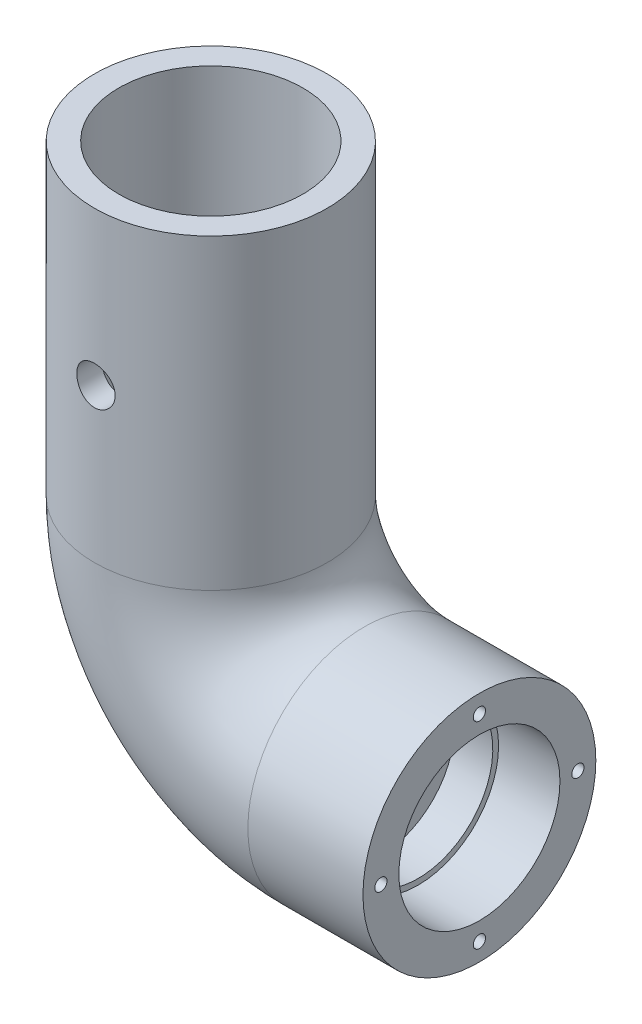
ISO-10303-21;
HEADER;
FILE_DESCRIPTION(('STEP AP214'),'2;1');
FILE_NAME('part.step','',(''),(''),'','','');
FILE_SCHEMA(('AUTOMOTIVE_DESIGN { 1 0 10303 214 1 1 1 1 }'));
ENDSEC;
DATA;
#1=APPLICATION_CONTEXT('core data for automotive mechanical design processes');
#2=APPLICATION_PROTOCOL_DEFINITION('international standard','automotive_design',2000,#1);
#3=PRODUCT_CONTEXT('',#1,'mechanical');
#4=PRODUCT('Part','Part','',(#3));
#5=PRODUCT_RELATED_PRODUCT_CATEGORY('part','',(#4));
#6=PRODUCT_DEFINITION_FORMATION('','',#4);
#7=PRODUCT_DEFINITION_CONTEXT('part definition',#1,'design');
#8=PRODUCT_DEFINITION('design','',#6,#7);
#9=PRODUCT_DEFINITION_SHAPE('','',#8);
#10=(LENGTH_UNIT() NAMED_UNIT(*) SI_UNIT(.MILLI.,.METRE.));
#11=(NAMED_UNIT(*) PLANE_ANGLE_UNIT() SI_UNIT($,.RADIAN.));
#12=(NAMED_UNIT(*) SI_UNIT($,.STERADIAN.) SOLID_ANGLE_UNIT());
#13=UNCERTAINTY_MEASURE_WITH_UNIT(LENGTH_MEASURE(1.E-05),#10,'distance_accuracy_value','');
#14=(GEOMETRIC_REPRESENTATION_CONTEXT(3) GLOBAL_UNCERTAINTY_ASSIGNED_CONTEXT((#13)) GLOBAL_UNIT_ASSIGNED_CONTEXT((#10,
#11,#12)) REPRESENTATION_CONTEXT('',''));
#15=CARTESIAN_POINT('',(0.,0.,0.));
#16=DIRECTION('',(0.,0.,1.));
#17=DIRECTION('',(1.,0.,0.));
#18=AXIS2_PLACEMENT_3D('',#15,#16,#17);
#19=CARTESIAN_POINT('',(0.,0.,0.));
#20=DIRECTION('',(0.,-1.,0.));
#21=DIRECTION('',(1.,0.,0.));
#22=AXIS2_PLACEMENT_3D('',#19,#20,#21);
#23=CYLINDRICAL_SURFACE('',#22,15.175);
#24=CARTESIAN_POINT('',(0.,-22.5,-15.175));
#25=CARTESIAN_POINT('',(0.139414398865808,-22.4999943896346,-15.1749976272161));
#26=CARTESIAN_POINT('',(0.278905464425863,-22.4882987839139,-15.1730587501058));
#27=CARTESIAN_POINT('',(0.553976908617769,-22.4418439121575,-15.1655108774113));
#28=CARTESIAN_POINT('',(0.689553544166285,-22.4070632871692,-15.1598984830454));
#29=CARTESIAN_POINT('',(0.952776474581509,-22.315515683128,-15.1456332250792));
#30=CARTESIAN_POINT('',(1.08042910035957,-22.2587665252279,-15.1369828264729));
#31=CARTESIAN_POINT('',(1.32438387408,-22.1249390484941,-15.1175932663015));
#32=CARTESIAN_POINT('',(1.44068735130687,-22.0478631143867,-15.1068543497989));
#33=CARTESIAN_POINT('',(1.65974650354689,-21.8748032292909,-15.0843664117185));
#34=CARTESIAN_POINT('',(1.76238066959243,-21.7786664565595,-15.0726096897185));
#35=CARTESIAN_POINT('',(1.95013834034263,-21.5705427935558,-15.0494702952056));
#36=CARTESIAN_POINT('',(2.03526075187495,-21.4585549145134,-15.0380876460815));
#37=CARTESIAN_POINT('',(2.1860638853002,-21.2210754679183,-15.0169105867145));
#38=CARTESIAN_POINT('',(2.25162476280527,-21.095506832648,-15.0071261266247));
#39=CARTESIAN_POINT('',(2.36067746971198,-20.834951174242,-14.9903599037316));
#40=CARTESIAN_POINT('',(2.40417075477263,-20.6999647730048,-14.9833779560707));
#41=CARTESIAN_POINT('',(2.46747147831426,-20.4256921790696,-14.9730838150865));
#42=CARTESIAN_POINT('',(2.4874884856634,-20.2864555946552,-14.9697391720144));
#43=CARTESIAN_POINT('',(2.50391814790731,-20.0065628667282,-14.967000127247));
#44=CARTESIAN_POINT('',(2.5003324350801,-19.8659068220521,-14.9676054523863));
#45=CARTESIAN_POINT('',(2.46982921038924,-19.5886620157808,-14.9726683175695));
#46=CARTESIAN_POINT('',(2.44314687659403,-19.4520465670754,-14.9770870270074));
#47=CARTESIAN_POINT('',(2.36757678705423,-19.1852583708687,-14.9892180148866));
#48=CARTESIAN_POINT('',(2.31868828567482,-19.0550858398695,-14.9969304039221));
#49=CARTESIAN_POINT('',(2.19985444806369,-18.8041731671425,-15.0148218186591));
#50=CARTESIAN_POINT('',(2.12981121823907,-18.6834802364751,-15.025012267932));
#51=CARTESIAN_POINT('',(1.97072572320153,-18.4554715653313,-15.0467036259348));
#52=CARTESIAN_POINT('',(1.88168195896249,-18.3481568813758,-15.0582046380267));
#53=CARTESIAN_POINT('',(1.68584050335828,-18.1485894502835,-15.0813919807029));
#54=CARTESIAN_POINT('',(1.57884098184814,-18.0565347149305,-15.0930788695123));
#55=CARTESIAN_POINT('',(1.35080857293345,-17.8916566165645,-15.1151924066283));
#56=CARTESIAN_POINT('',(1.22977559891994,-17.8188333722498,-15.1256190471563));
#57=CARTESIAN_POINT('',(0.976927538134907,-17.6944683679727,-15.1440516025845));
#58=CARTESIAN_POINT('',(0.845103827113141,-17.6429438334506,-15.1520555567296));
#59=CARTESIAN_POINT('',(0.574512707580694,-17.5628212020278,-15.1647250919528));
#60=CARTESIAN_POINT('',(0.435745867449411,-17.5342212317249,-15.1693909458181));
#61=CARTESIAN_POINT('',(0.156914525463659,-17.5010273885496,-15.1748219504465));
#62=CARTESIAN_POINT('',(0.0168832197418992,-17.496161638441,-15.1756312755361));
#63=CARTESIAN_POINT('',(-0.261994008747119,-17.5098499053041,-15.1733789340442));
#64=CARTESIAN_POINT('',(-0.400839975845774,-17.5284030425174,-15.1703174128756));
#65=CARTESIAN_POINT('',(-0.672567381257066,-17.5881763026265,-15.1606947221205));
#66=CARTESIAN_POINT('',(-0.805479169890742,-17.6292620824038,-15.1541543011709));
#67=CARTESIAN_POINT('',(-1.06252816449593,-17.7327913246536,-15.1383043082592));
#68=CARTESIAN_POINT('',(-1.18666488669078,-17.7952359635511,-15.1289945837702));
#69=CARTESIAN_POINT('',(-1.42382265695125,-17.9403348574233,-15.1085293914326));
#70=CARTESIAN_POINT('',(-1.53673826212985,-18.0231592592062,-15.0973586539619));
#71=CARTESIAN_POINT('',(-1.74716482059952,-18.206432202769,-15.0744573429873));
#72=CARTESIAN_POINT('',(-1.84467468125567,-18.3068819935443,-15.0627267298517));
#73=CARTESIAN_POINT('',(-2.02252736832566,-18.5237726086314,-15.0398852756684));
#74=CARTESIAN_POINT('',(-2.10268667257686,-18.640364832744,-15.0287818993821));
#75=CARTESIAN_POINT('',(-2.2422818354755,-18.8855194334708,-15.0085906335615));
#76=CARTESIAN_POINT('',(-2.30171834000595,-19.0140814368556,-14.9995026812143));
#77=CARTESIAN_POINT('',(-2.39790504111838,-19.2790089514247,-14.9844270142086));
#78=CARTESIAN_POINT('',(-2.43474721383671,-19.4153403225006,-14.9784267466052));
#79=CARTESIAN_POINT('',(-2.48498928304665,-19.6923633131354,-14.9701741030155));
#80=CARTESIAN_POINT('',(-2.49839116632715,-19.8330545621239,-14.9679214093872));
#81=CARTESIAN_POINT('',(-2.50131779480933,-20.1129714213662,-14.9674324446329));
#82=CARTESIAN_POINT('',(-2.49113137271242,-20.2521940114351,-14.9691475881172));
#83=CARTESIAN_POINT('',(-2.44779442269011,-20.5269157289199,-14.9762946698811));
#84=CARTESIAN_POINT('',(-2.41464396432517,-20.6624148676133,-14.981726596902));
#85=CARTESIAN_POINT('',(-2.32642959985729,-20.925735464551,-14.995676918027));
#86=CARTESIAN_POINT('',(-2.27139000080984,-21.0535652587068,-15.0041918875934));
#87=CARTESIAN_POINT('',(-2.14098927733165,-21.2982232322297,-15.0233522865409));
#88=CARTESIAN_POINT('',(-2.06562718298227,-21.4150508861456,-15.0339978175995));
#89=CARTESIAN_POINT('',(-1.89568766005889,-21.6358485375619,-15.0563741511314));
#90=CARTESIAN_POINT('',(-1.80089756283132,-21.7396537447931,-15.0681161060429));
#91=CARTESIAN_POINT('',(-1.59524139211507,-21.9299838666002,-15.0912728166213));
#92=CARTESIAN_POINT('',(-1.48437161109691,-22.0165047849302,-15.1026874960986));
#93=CARTESIAN_POINT('',(-1.2488170646922,-22.1703413571105,-15.123992442743));
#94=CARTESIAN_POINT('',(-1.12404431677095,-22.2375237923058,-15.1338719296207));
#95=CARTESIAN_POINT('',(-0.864873538687186,-22.3498726180061,-15.1508883617483));
#96=CARTESIAN_POINT('',(-0.730485296368456,-22.3950610411048,-15.1580280500793));
#97=CARTESIAN_POINT('',(-0.496304062504727,-22.4522773457695,-15.1671937279183));
#98=CARTESIAN_POINT('',(-0.397931369105154,-22.4701448389185,-15.1701055070724));
#99=CARTESIAN_POINT('',(-0.199718884105704,-22.4940080772245,-15.1740094771408));
#100=CARTESIAN_POINT('',(-0.0998791168774065,-22.5000040193721,-15.1750016999073));
#101=CARTESIAN_POINT('',(0.,-22.5,-15.175));
#102=B_SPLINE_CURVE_WITH_KNOTS('',3,(#24,#25,#26,#27,#28,#29,#30,#31,#32,#33,#34,#35,#36,#37,
#38,#39,#40,#41,#42,#43,#44,#45,#46,#47,#48,#49,#50,#51,#52,#53,#54,#55,#56,#57,#58,#59,#60,#61,
#62,#63,#64,#65,#66,#67,#68,#69,#70,#71,#72,#73,#74,#75,#76,#77,#78,#79,#80,#81,#82,#83,#84,#85,
#86,#87,#88,#89,#90,#91,#92,#93,#94,#95,#96,#97,#98,#99,#100,#101),.UNSPECIFIED.,.T.,.F.,(4,2,2,
2,2,2,2,2,2,2,2,2,2,2,2,2,2,2,2,2,2,2,2,2,2,2,2,2,2,2,2,2,2,2,2,2,2,2,4),(0.,0.41787812372333,
0.836143420794595,1.25407012437152,1.67194781881058,2.09332223264384,2.51472294282414,
2.93865473107456,3.36255855159899,3.78264873313769,4.20270986307726,4.6185434319839,
5.03439096470981,5.45219311037727,5.87002823027735,6.29292034777012,6.71581507532566,
7.13905115513656,7.56225264444306,7.98059475770539,8.39892115591529,8.81478012172434,
9.23066199632983,9.6501413772678,10.0696504959617,10.4934007808007,10.9171378571164,
11.3391383481926,11.7611030689542,12.177928306698,12.5947522818403,13.0111146765413,
13.42749694622,13.8487071405818,14.2700146091994,14.6941584789878,15.1178765818797,
15.4172573552029,15.716633160711),.UNSPECIFIED.);
#103=CARTESIAN_POINT('',(0.,-22.5,-15.175));
#104=VERTEX_POINT('',#103);
#105=EDGE_CURVE('E120',#104,#104,#102,.T.);
#106=ORIENTED_EDGE('',*,*,#105,.T.);
#107=EDGE_LOOP('',(#106));
#108=FACE_BOUND('',#107,.T.);
#109=CARTESIAN_POINT('',(2.5,-20.,14.9676526215703));
#110=CARTESIAN_POINT('',(2.49999437753145,-20.1393999267453,14.9676551180879));
#111=CARTESIAN_POINT('',(2.48830111786953,-20.2788765566367,14.9696211562426));
#112=CARTESIAN_POINT('',(2.44185640998583,-20.5539180169733,14.9772659392603));
#113=CARTESIAN_POINT('',(2.40708354964725,-20.6894790927744,14.9829481317163));
#114=CARTESIAN_POINT('',(2.31555865143851,-20.9526690924642,14.9973645861903));
#115=CARTESIAN_POINT('',(2.25882480120892,-21.0803044790087,15.0060963220557));
#116=CARTESIAN_POINT('',(2.12503339399969,-21.3242302625616,15.0256250294047));
#117=CARTESIAN_POINT('',(2.04797818538789,-21.4405219683377,15.0364217622144));
#118=CARTESIAN_POINT('',(1.87493941802263,-21.6595939794028,15.058980173431));
#119=CARTESIAN_POINT('',(1.77879839195252,-21.7622491485628,15.070749368773));
#120=CARTESIAN_POINT('',(1.57065734652026,-21.9500474796948,15.093859799345));
#121=CARTESIAN_POINT('',(1.45865639626467,-22.0351896130247,15.1052010094051));
#122=CARTESIAN_POINT('',(1.22116506767708,-22.1860137177612,15.1262570623383));
#123=CARTESIAN_POINT('',(1.09559987050167,-22.2515793723053,15.1359620405751));
#124=CARTESIAN_POINT('',(0.835051668386316,-22.3606418535047,15.1525685385449));
#125=CARTESIAN_POINT('',(0.700069262525742,-22.4041400825342,15.1594702364195));
#126=CARTESIAN_POINT('',(0.425810661145654,-22.4674506254424,15.1696394784589));
#127=CARTESIAN_POINT('',(0.286584197046825,-22.4874731126365,15.1729392511872));
#128=CARTESIAN_POINT('',(0.00671141486839491,-22.5039172432033,15.1756435441433));
#129=CARTESIAN_POINT('',(-0.133934808197582,-22.5003404555765,15.1750483233304));
#130=CARTESIAN_POINT('',(-0.41121803848185,-22.469851710033,15.1700552355333));
#131=CARTESIAN_POINT('',(-0.547880673761921,-22.4431659306239,15.1656942272407));
#132=CARTESIAN_POINT('',(-0.814761449668491,-22.3675727282069,15.1537006619462));
#133=CARTESIAN_POINT('',(-0.944979397431581,-22.3186646406206,15.1460680071031));
#134=CARTESIAN_POINT('',(-1.19594846883266,-22.1997895495433,15.1283259313806));
#135=CARTESIAN_POINT('',(-1.31665452718145,-22.129729105392,15.1182055586322));
#136=CARTESIAN_POINT('',(-1.54468222462871,-21.9706064898069,15.0966128588608));
#137=CARTESIAN_POINT('',(-1.65200280365272,-21.8815428149081,15.0851404249));
#138=CARTESIAN_POINT('',(-1.85154905797987,-21.6856867861696,15.0619593732846));
#139=CARTESIAN_POINT('',(-1.9435806997378,-21.578696775483,15.050249568021));
#140=CARTESIAN_POINT('',(-2.10841667184125,-21.3506917785872,15.0280452193332));
#141=CARTESIAN_POINT('',(-2.18122083261723,-21.2296766687026,15.017550686627));
#142=CARTESIAN_POINT('',(-2.30557190897048,-20.9768343582631,14.9989646164783));
#143=CARTESIAN_POINT('',(-2.35709587383962,-20.8449956671501,14.9908756760863));
#144=CARTESIAN_POINT('',(-2.43721281865678,-20.5743718545755,14.9780599773409));
#145=CARTESIAN_POINT('',(-2.46580776855682,-20.4355873309555,14.9733329301534));
#146=CARTESIAN_POINT('',(-2.49898261040989,-20.156746346404,14.9678319843484));
#147=CARTESIAN_POINT('',(-2.50383891364147,-20.0167236395285,14.9670125880507));
#148=CARTESIAN_POINT('',(-2.49013482253626,-19.7378658422321,14.9692985803764));
#149=CARTESIAN_POINT('',(-2.47157531103841,-19.5990307072352,14.9724038210305));
#150=CARTESIAN_POINT('',(-2.41180194782285,-19.3273644989315,14.9821471978688));
#151=CARTESIAN_POINT('',(-2.37072843313684,-19.1945016933949,14.9887634407823));
#152=CARTESIAN_POINT('',(-2.26724002928118,-18.93754527134,15.0047650039361));
#153=CARTESIAN_POINT('',(-2.20482388981765,-18.8134521690826,15.0141504863996));
#154=CARTESIAN_POINT('',(-2.05976821986048,-18.576326441883,15.0347389141977));
#155=CARTESIAN_POINT('',(-1.97695134127624,-18.4634036865835,15.0459574904166));
#156=CARTESIAN_POINT('',(-1.793688852085,-18.2529592243713,15.0689021728662));
#157=CARTESIAN_POINT('',(-1.69324203106521,-18.1554385757896,15.080628313903));
#158=CARTESIAN_POINT('',(-1.47634722768876,-17.977559240765,15.1034105920265));
#159=CARTESIAN_POINT('',(-1.35974721238203,-17.89738475317,15.1144587225039));
#160=CARTESIAN_POINT('',(-1.11457265927855,-17.7577629854935,15.1345121885892));
#161=CARTESIAN_POINT('',(-0.985998502079841,-17.6983150469034,15.143517589094));
#162=CARTESIAN_POINT('',(-0.721075975376979,-17.6021214508171,15.1584360969103));
#163=CARTESIAN_POINT('',(-0.584763567857759,-17.5652788841367,15.1643623873628));
#164=CARTESIAN_POINT('',(-0.30778084171827,-17.5150296135941,15.1725106301449));
#165=CARTESIAN_POINT('',(-0.167110874028081,-17.5016210274765,15.1747328799885));
#166=CARTESIAN_POINT('',(0.11281497152143,-17.4986735132137,15.1752185964705));
#167=CARTESIAN_POINT('',(0.252067895513671,-17.5088541334636,15.1735285762314));
#168=CARTESIAN_POINT('',(0.52685180012298,-17.5521900955504,15.166474457857));
#169=CARTESIAN_POINT('',(0.662382800422101,-17.5853453158702,15.1611103791546));
#170=CARTESIAN_POINT('',(0.925772139210983,-17.6735826635033,15.1473086471497));
#171=CARTESIAN_POINT('',(1.05363847085306,-17.7286414740673,15.1388742630488));
#172=CARTESIAN_POINT('',(1.29836159830794,-17.859092025037,15.1198533321971));
#173=CARTESIAN_POINT('',(1.41521789129942,-17.9344846934699,15.1092666872237));
#174=CARTESIAN_POINT('',(1.636017776678,-18.1044594735508,15.0869659065394));
#175=CARTESIAN_POINT('',(1.73980198404174,-18.1992471672561,15.075240464941));
#176=CARTESIAN_POINT('',(1.93009085206402,-18.4048896771067,15.0520625438541));
#177=CARTESIAN_POINT('',(2.01659145961134,-18.5157482514807,15.0406101289453));
#178=CARTESIAN_POINT('',(2.17040420392537,-18.7512921233202,15.0191897349432));
#179=CARTESIAN_POINT('',(2.23757995888379,-18.8760674645766,15.009232532672));
#180=CARTESIAN_POINT('',(2.34991559412669,-19.1352433660101,14.9920571811202));
#181=CARTESIAN_POINT('',(2.39509757159692,-19.2696341091762,14.984836284292));
#182=CARTESIAN_POINT('',(2.45229718265444,-19.503798457514,14.9755606203287));
#183=CARTESIAN_POINT('',(2.47015720034298,-19.602150625457,14.9726115170199));
#184=CARTESIAN_POINT('',(2.49401051915724,-19.8003220925829,14.9686566404333));
#185=CARTESIAN_POINT('',(2.50000402763504,-19.9001413660994,14.9676508331989));
#186=CARTESIAN_POINT('',(2.5,-20.,14.9676526215703));
#187=B_SPLINE_CURVE_WITH_KNOTS('',3,(#109,#110,#111,#112,#113,#114,#115,#116,#117,#118,#119,
#120,#121,#122,#123,#124,#125,#126,#127,#128,#129,#130,#131,#132,#133,#134,#135,#136,#137,#138,
#139,#140,#141,#142,#143,#144,#145,#146,#147,#148,#149,#150,#151,#152,#153,#154,#155,#156,#157,
#158,#159,#160,#161,#162,#163,#164,#165,#166,#167,#168,#169,#170,#171,#172,#173,#174,#175,#176,
#177,#178,#179,#180,#181,#182,#183,#184,#185,#186),.UNSPECIFIED.,.T.,.F.,(4,2,2,2,2,2,2,2,2,2,2,
2,2,2,2,2,2,2,2,2,2,2,2,2,2,2,2,2,2,2,2,2,2,2,2,2,2,2,4),(0.,0.417834635783439,
0.836057460827383,1.2539346608241,1.67176359142487,2.09319493100717,2.51465101663454,
2.93856357781654,3.36244919618391,3.78251015586624,4.20254318802481,4.61851103794085,
5.03449132857299,5.4523367909029,5.87021532387711,6.29304781911748,6.71588404324549,
7.13917511319949,7.56242981209845,7.98074422465046,8.39904286610005,8.81476328816452,
9.23050806814065,9.65000311215194,10.0695269685621,10.493308074036,10.9170757142241,
11.3390137329823,11.7609178594373,12.1778317545286,12.5947434444962,13.0112125072967,
13.4277005807589,13.8488561182219,14.2701103036515,14.6942683127586,15.1179992854832,
15.4173188475488,15.7166331793412),.UNSPECIFIED.);
#188=CARTESIAN_POINT('',(2.5,-20.,14.9676526215703));
#189=VERTEX_POINT('',#188);
#190=EDGE_CURVE('E112',#189,#189,#187,.T.);
#191=ORIENTED_EDGE('',*,*,#190,.T.);
#192=EDGE_LOOP('',(#191));
#193=FACE_BOUND('',#192,.T.);
#194=CARTESIAN_POINT('',(0.,-40.,0.));
#195=DIRECTION('',(0.,1.,0.));
#196=DIRECTION('',(0.,0.,1.));
#197=AXIS2_PLACEMENT_3D('',#194,#195,#196);
#198=CIRCLE('',#197,15.175);
#199=CARTESIAN_POINT('',(-15.175,-40.,0.));
#200=VERTEX_POINT('',#199);
#201=EDGE_CURVE('E189',#200,#200,#198,.T.);
#202=ORIENTED_EDGE('',*,*,#201,.T.);
#203=EDGE_LOOP('',(#202));
#204=FACE_BOUND('',#203,.T.);
#205=CARTESIAN_POINT('',(0.,0.,0.));
#206=DIRECTION('',(0.,1.,0.));
#207=DIRECTION('',(0.,0.,1.));
#208=AXIS2_PLACEMENT_3D('',#205,#206,#207);
#209=CIRCLE('',#208,15.175);
#210=CARTESIAN_POINT('',(0.,0.,15.175));
#211=VERTEX_POINT('',#210);
#212=EDGE_CURVE('E177',#211,#211,#209,.T.);
#213=ORIENTED_EDGE('',*,*,#212,.F.);
#214=EDGE_LOOP('',(#213));
#215=FACE_BOUND('',#214,.T.);
#216=ADVANCED_FACE('F40',(#108,#193,#204,#215),#23,.T.);
#217=CARTESIAN_POINT('',(20.,-40.,0.));
#218=DIRECTION('',(0.,0.,1.));
#219=DIRECTION('',(1.,0.,0.));
#220=AXIS2_PLACEMENT_3D('',#217,#218,#219);
#221=TOROIDAL_SURFACE('',#220,20.,15.175);
#222=CARTESIAN_POINT('',(20.,-60.,0.));
#223=DIRECTION('',(-1.,0.,0.));
#224=DIRECTION('',(0.,0.,1.));
#225=AXIS2_PLACEMENT_3D('',#222,#223,#224);
#226=CIRCLE('',#225,15.175);
#227=CARTESIAN_POINT('',(20.,-75.175,0.));
#228=VERTEX_POINT('',#227);
#229=EDGE_CURVE('E181',#228,#228,#226,.T.);
#230=CARTESIAN_POINT('',(20.,-40.,0.));
#231=DIRECTION('',(0.,0.,1.));
#232=DIRECTION('',(1.,0.,0.));
#233=AXIS2_PLACEMENT_3D('',#230,#231,#232);
#234=CIRCLE('',#233,35.175);
#235=EDGE_CURVE('',#200,#228,#234,.T.);
#236=ORIENTED_EDGE('',*,*,#201,.F.);
#237=ORIENTED_EDGE('',*,*,#229,.T.);
#238=ORIENTED_EDGE('',*,*,#235,.T.);
#239=ORIENTED_EDGE('',*,*,#235,.F.);
#240=EDGE_LOOP('',(#236,#238,#237,#239));
#241=FACE_BOUND('',#240,.T.);
#242=ADVANCED_FACE('F169',(#241),#221,.T.);
#243=CARTESIAN_POINT('',(20.,-60.,0.));
#244=DIRECTION('',(1.,0.,0.));
#245=DIRECTION('',(0.,1.,0.));
#246=AXIS2_PLACEMENT_3D('',#243,#244,#245);
#247=CYLINDRICAL_SURFACE('',#246,15.175);
#248=CARTESIAN_POINT('',(35.,-60.,0.));
#249=DIRECTION('',(-1.,0.,0.));
#250=DIRECTION('',(0.,0.,1.));
#251=AXIS2_PLACEMENT_3D('',#248,#249,#250);
#252=CIRCLE('',#251,15.175);
#253=CARTESIAN_POINT('',(35.,-60.,15.175));
#254=VERTEX_POINT('',#253);
#255=EDGE_CURVE('E180',#254,#254,#252,.T.);
#256=ORIENTED_EDGE('',*,*,#255,.T.);
#257=EDGE_LOOP('',(#256));
#258=FACE_BOUND('',#257,.T.);
#259=ORIENTED_EDGE('',*,*,#229,.F.);
#260=EDGE_LOOP('',(#259));
#261=FACE_BOUND('',#260,.T.);
#262=ADVANCED_FACE('F42',(#258,#261),#247,.T.);
#263=CARTESIAN_POINT('',(0.,0.,0.));
#264=DIRECTION('',(0.,1.,0.));
#265=DIRECTION('',(0.,0.,1.));
#266=AXIS2_PLACEMENT_3D('',#263,#264,#265);
#267=PLANE('',#266);
#268=CARTESIAN_POINT('',(0.,0.,0.));
#269=DIRECTION('',(0.,1.,0.));
#270=DIRECTION('',(0.,0.,1.));
#271=AXIS2_PLACEMENT_3D('',#268,#269,#270);
#272=CIRCLE('',#271,12.);
#273=CARTESIAN_POINT('',(0.,0.,12.));
#274=VERTEX_POINT('',#273);
#275=EDGE_CURVE('E174',#274,#274,#272,.F.);
#276=ORIENTED_EDGE('',*,*,#275,.T.);
#277=EDGE_LOOP('',(#276));
#278=FACE_BOUND('',#277,.T.);
#279=ORIENTED_EDGE('',*,*,#212,.T.);
#280=EDGE_LOOP('',(#279));
#281=FACE_BOUND('',#280,.T.);
#282=ADVANCED_FACE('F162',(#278,#281),#267,.T.);
#283=CARTESIAN_POINT('',(35.,-60.,0.));
#284=DIRECTION('',(-1.,0.,0.));
#285=DIRECTION('',(0.,0.,1.));
#286=AXIS2_PLACEMENT_3D('',#283,#284,#285);
#287=PLANE('',#286);
#288=CARTESIAN_POINT('',(35.,-47.1625,0.));
#289=DIRECTION('',(1.,0.,0.));
#290=DIRECTION('',(0.,0.,-1.));
#291=AXIS2_PLACEMENT_3D('',#288,#289,#290);
#292=CIRCLE('',#291,0.800000000000002);
#293=CARTESIAN_POINT('',(35.,-47.1625,-0.800000000000002));
#294=VERTEX_POINT('',#293);
#295=EDGE_CURVE('E81',#294,#294,#292,.T.);
#296=ORIENTED_EDGE('',*,*,#295,.F.);
#297=EDGE_LOOP('',(#296));
#298=FACE_BOUND('',#297,.T.);
#299=CARTESIAN_POINT('',(35.,-60.,-12.8375));
#300=DIRECTION('',(1.,0.,0.));
#301=DIRECTION('',(0.,0.,-1.));
#302=AXIS2_PLACEMENT_3D('',#299,#300,#301);
#303=CIRCLE('',#302,0.800000000000002);
#304=CARTESIAN_POINT('',(35.,-60.,-13.6375));
#305=VERTEX_POINT('',#304);
#306=EDGE_CURVE('E80',#305,#305,#303,.T.);
#307=ORIENTED_EDGE('',*,*,#306,.F.);
#308=EDGE_LOOP('',(#307));
#309=FACE_BOUND('',#308,.T.);
#310=CARTESIAN_POINT('',(35.,-72.8375,0.));
#311=DIRECTION('',(1.,0.,0.));
#312=DIRECTION('',(0.,0.,-1.));
#313=AXIS2_PLACEMENT_3D('',#310,#311,#312);
#314=CIRCLE('',#313,0.799999999999995);
#315=CARTESIAN_POINT('',(35.,-72.8375,-0.799999999999995));
#316=VERTEX_POINT('',#315);
#317=EDGE_CURVE('E95',#316,#316,#314,.T.);
#318=ORIENTED_EDGE('',*,*,#317,.F.);
#319=EDGE_LOOP('',(#318));
#320=FACE_BOUND('',#319,.T.);
#321=CARTESIAN_POINT('',(35.,-60.,12.8375));
#322=DIRECTION('',(1.,0.,0.));
#323=DIRECTION('',(0.,0.,-1.));
#324=AXIS2_PLACEMENT_3D('',#321,#322,#323);
#325=CIRCLE('',#324,0.800000000000002);
#326=CARTESIAN_POINT('',(35.,-60.,12.0375));
#327=VERTEX_POINT('',#326);
#328=EDGE_CURVE('E103',#327,#327,#325,.T.);
#329=ORIENTED_EDGE('',*,*,#328,.F.);
#330=EDGE_LOOP('',(#329));
#331=FACE_BOUND('',#330,.T.);
#332=ORIENTED_EDGE('',*,*,#255,.F.);
#333=EDGE_LOOP('',(#332));
#334=FACE_BOUND('',#333,.T.);
#335=CARTESIAN_POINT('',(35.,-60.,0.));
#336=DIRECTION('',(-1.,0.,0.));
#337=DIRECTION('',(0.,-1.,0.));
#338=AXIS2_PLACEMENT_3D('',#335,#336,#337);
#339=CIRCLE('',#338,10.5);
#340=CARTESIAN_POINT('',(35.,-70.5,0.));
#341=VERTEX_POINT('',#340);
#342=EDGE_CURVE('E215',#341,#341,#339,.T.);
#343=ORIENTED_EDGE('',*,*,#342,.T.);
#344=EDGE_LOOP('',(#343));
#345=FACE_BOUND('',#344,.T.);
#346=ADVANCED_FACE('F153',(#298,#309,#320,#331,#334,#345),#287,.F.);
#347=CARTESIAN_POINT('',(0.,0.,0.));
#348=DIRECTION('',(0.,-1.,0.));
#349=DIRECTION('',(1.,0.,0.));
#350=AXIS2_PLACEMENT_3D('',#347,#348,#349);
#351=CYLINDRICAL_SURFACE('',#350,12.);
#352=CARTESIAN_POINT('',(2.5,-20.,-11.7366945943055));
#353=CARTESIAN_POINT('',(2.499995017553,-20.1387812303038,-11.7366973843002));
#354=CARTESIAN_POINT('',(2.48840458867923,-20.2776239440309,-11.7391829184982));
#355=CARTESIAN_POINT('',(2.44239298467531,-20.551372634634,-11.7488403116286));
#356=CARTESIAN_POINT('',(2.40795430880677,-20.6862755110127,-11.7560157627658));
#357=CARTESIAN_POINT('',(2.31736795014468,-20.9481447456699,-11.7742058592406));
#358=CARTESIAN_POINT('',(2.26124282497867,-21.0751191919836,-11.7852165141394));
#359=CARTESIAN_POINT('',(2.12893977203463,-21.3178489992912,-11.8098316267143));
#360=CARTESIAN_POINT('',(2.05276265471639,-21.43360481346,-11.8234359795523));
#361=CARTESIAN_POINT('',(1.88127279893217,-21.6523907503069,-11.8519386932295));
#362=CARTESIAN_POINT('',(1.78571110973934,-21.7552237872529,-11.8668522874608));
#363=CARTESIAN_POINT('',(1.57870244776127,-21.9435221372962,-11.8961593360515));
#364=CARTESIAN_POINT('',(1.46725431091201,-22.0289861765829,-11.9105527521983));
#365=CARTESIAN_POINT('',(1.23032410599918,-22.1808917761657,-11.937362702377));
#366=CARTESIAN_POINT('',(1.10471885640988,-22.2471450529265,-11.9497591726249));
#367=CARTESIAN_POINT('',(0.84385710201344,-22.3575321057196,-11.971006946866));
#368=CARTESIAN_POINT('',(0.708601579901182,-22.4016681303071,-11.9798586112245));
#369=CARTESIAN_POINT('',(0.434325808401004,-22.4659515222349,-11.9929117978436));
#370=CARTESIAN_POINT('',(0.295386761832715,-22.4864320343903,-11.9971778391985));
#371=CARTESIAN_POINT('',(0.0159836976790481,-22.503863391514,-12.0008022516122));
#372=CARTESIAN_POINT('',(-0.124480159473678,-22.5008166883862,-12.0001611340738));
#373=CARTESIAN_POINT('',(-0.400653172399145,-22.4715307980865,-11.9940931618102));
#374=CARTESIAN_POINT('',(-0.536402257452952,-22.4456505620838,-11.9887403791317));
#375=CARTESIAN_POINT('',(-0.801587492579507,-22.3720027493374,-11.9739344179777));
#376=CARTESIAN_POINT('',(-0.931023375022047,-22.3242342455939,-11.9644810658381));
#377=CARTESIAN_POINT('',(-1.18092001076937,-22.207839895749,-11.9424153464785));
#378=CARTESIAN_POINT('',(-1.3013142699633,-22.1390754115807,-11.9297820825069));
#379=CARTESIAN_POINT('',(-1.5289869130213,-21.9827439943192,-11.9027460088038));
#380=CARTESIAN_POINT('',(-1.63626366363284,-21.8951747235877,-11.8883429791665));
#381=CARTESIAN_POINT('',(-1.83678840655383,-21.7017567502179,-11.8590340046655));
#382=CARTESIAN_POINT('',(-1.92973297498959,-21.5955938800361,-11.8441236995185));
#383=CARTESIAN_POINT('',(-2.09655194480976,-21.3690359020104,-11.8157374529799));
#384=CARTESIAN_POINT('',(-2.1704259213996,-21.2486404772255,-11.8022615435432));
#385=CARTESIAN_POINT('',(-2.29712434276909,-20.9965754903424,-11.7782599681831));
#386=CARTESIAN_POINT('',(-2.34989610979455,-20.8648786986131,-11.7677417046425));
#387=CARTESIAN_POINT('',(-2.43247155077346,-20.5942167612612,-11.7509521282072));
#388=CARTESIAN_POINT('',(-2.46227849764698,-20.4552526543838,-11.7446802101436));
#389=CARTESIAN_POINT('',(-2.49761727734035,-20.1767605873622,-11.7372156647826));
#390=CARTESIAN_POINT('',(-2.50358885835997,-20.0372908309259,-11.7359310372695));
#391=CARTESIAN_POINT('',(-2.49227386878589,-19.7593483769197,-11.7383390403741));
#392=CARTESIAN_POINT('',(-2.47498873715726,-19.6208756181953,-11.7420313630525));
#393=CARTESIAN_POINT('',(-2.41803116650968,-19.3503589678837,-11.7538907645233));
#394=CARTESIAN_POINT('',(-2.37859682753743,-19.2182626656423,-11.7620102256599));
#395=CARTESIAN_POINT('',(-2.27871621721839,-18.9625520211168,-11.7817667700624));
#396=CARTESIAN_POINT('',(-2.21826809112293,-18.8389384286992,-11.7934041638211));
#397=CARTESIAN_POINT('',(-2.0770919636297,-18.6017871175675,-11.8190900387438));
#398=CARTESIAN_POINT('',(-1.99609065470793,-18.4884155910677,-11.8331701329665));
#399=CARTESIAN_POINT('',(-1.81646888113976,-18.2767135016899,-11.8620696798782));
#400=CARTESIAN_POINT('',(-1.71784644101035,-18.1783846275215,-11.8768892153306));
#401=CARTESIAN_POINT('',(-1.50380090168668,-17.9978745738057,-11.9058984863347));
#402=CARTESIAN_POINT('',(-1.38812381522911,-17.9159918099472,-11.9200734943982));
#403=CARTESIAN_POINT('',(-1.14440020443272,-17.772822495824,-11.9459341754481));
#404=CARTESIAN_POINT('',(-1.01635422695376,-17.7115350355251,-11.9576199584164));
#405=CARTESIAN_POINT('',(-0.75228423569584,-17.6117226413653,-11.9771229654136));
#406=CARTESIAN_POINT('',(-0.616313421940393,-17.5730616689113,-11.9849632627299));
#407=CARTESIAN_POINT('',(-0.339626801006946,-17.5191711919838,-11.9959912282046));
#408=CARTESIAN_POINT('',(-0.198911618923386,-17.5039386129345,-11.9991795068579));
#409=CARTESIAN_POINT('',(0.0804266869406713,-17.497464755903,-12.0005281611387));
#410=CARTESIAN_POINT('',(0.219039184355821,-17.5057762000105,-11.9987822750957));
#411=CARTESIAN_POINT('',(0.492845740747128,-17.5451612773059,-11.99065748189));
#412=CARTESIAN_POINT('',(0.62803985040549,-17.5762345728137,-11.9842786434588));
#413=CARTESIAN_POINT('',(0.890863930984022,-17.660055589297,-11.9676092015489));
#414=CARTESIAN_POINT('',(1.01851310000874,-17.7127453277057,-11.9573290681437));
#415=CARTESIAN_POINT('',(1.2632211344418,-17.8382447954646,-11.9339599069615));
#416=CARTESIAN_POINT('',(1.38027907656019,-17.9110562766883,-11.9208706346327));
#417=CARTESIAN_POINT('',(1.60268064259534,-18.0762193359845,-11.8930319356995));
#418=CARTESIAN_POINT('',(1.70778526722739,-18.1688885761055,-11.8782576059507));
#419=CARTESIAN_POINT('',(1.90110548396524,-18.3704890020021,-11.8488557363333));
#420=CARTESIAN_POINT('',(1.98931704315914,-18.4794240599264,-11.8342282323044));
#421=CARTESIAN_POINT('',(2.14734903704121,-18.712018204841,-11.8065838324643));
#422=CARTESIAN_POINT('',(2.21693856248136,-18.8358368228206,-11.7935881325424));
#423=CARTESIAN_POINT('',(2.3342125584477,-19.0936503120621,-11.7709407916825));
#424=CARTESIAN_POINT('',(2.381916325835,-19.2276360968785,-11.7612862067076));
#425=CARTESIAN_POINT('',(2.44513108264677,-19.4682125631532,-11.7482800883641));
#426=CARTESIAN_POINT('',(2.46566898011599,-19.5734590731905,-11.7439632719021));
#427=CARTESIAN_POINT('',(2.49310508716551,-19.7857915610376,-11.7381695052653));
#428=CARTESIAN_POINT('',(2.50000384585405,-19.8928774646188,-11.7366924407628));
#429=CARTESIAN_POINT('',(2.5,-20.,-11.7366945943055));
#430=B_SPLINE_CURVE_WITH_KNOTS('',3,(#352,#353,#354,#355,#356,#357,#358,#359,#360,#361,#362,
#363,#364,#365,#366,#367,#368,#369,#370,#371,#372,#373,#374,#375,#376,#377,#378,#379,#380,#381,
#382,#383,#384,#385,#386,#387,#388,#389,#390,#391,#392,#393,#394,#395,#396,#397,#398,#399,#400,
#401,#402,#403,#404,#405,#406,#407,#408,#409,#410,#411,#412,#413,#414,#415,#416,#417,#418,#419,
#420,#421,#422,#423,#424,#425,#426,#427,#428,#429),.UNSPECIFIED.,.T.,.F.,(4,2,2,2,2,2,2,2,2,2,2,
2,2,2,2,2,2,2,2,2,2,2,2,2,2,2,2,2,2,2,2,2,2,2,2,2,2,2,4),(0.,0.415951308142543,
0.832221584834943,1.24806002960546,1.66388166963159,2.0854266693577,2.50700257327748,
2.93258052533688,3.35811520213867,3.7775809771853,4.19700303792678,4.60994682832923,
5.02290810911742,5.438657439559,5.85445848208521,6.27811724489828,6.70178544383257,
7.12650474664977,7.55116350775196,7.96795032019586,8.3847113459305,8.79707572463847,
9.20947650928064,9.62767835869303,10.0459271216437,10.4711891750669,10.8964324351808,
11.3190919929707,11.7416960791916,12.1563258784529,12.5709495266597,12.984468211702,
13.3980229105635,13.8187663795715,14.2396101685507,14.6654530271772,15.0909196914727,
15.4119973517484,15.7330620852562),.UNSPECIFIED.);
#431=CARTESIAN_POINT('',(2.5,-20.,-11.7366945943055));
#432=VERTEX_POINT('',#431);
#433=EDGE_CURVE('E44',#432,#432,#430,.T.);
#434=ORIENTED_EDGE('',*,*,#433,.T.);
#435=EDGE_LOOP('',(#434));
#436=FACE_BOUND('',#435,.T.);
#437=CARTESIAN_POINT('',(2.5,-20.,11.7366945943055));
#438=CARTESIAN_POINT('',(2.499995017553,-19.8612187696962,11.7366973843002));
#439=CARTESIAN_POINT('',(2.48840458867923,-19.7223760559691,11.7391829184982));
#440=CARTESIAN_POINT('',(2.44239298467531,-19.448627365366,11.7488403116286));
#441=CARTESIAN_POINT('',(2.40795430880677,-19.3137244889873,11.7560157627658));
#442=CARTESIAN_POINT('',(2.31736795014468,-19.0518552543301,11.7742058592406));
#443=CARTESIAN_POINT('',(2.26124282497867,-18.9248808080164,11.7852165141394));
#444=CARTESIAN_POINT('',(2.12893977203463,-18.6821510007088,11.8098316267143));
#445=CARTESIAN_POINT('',(2.05276265471639,-18.56639518654,11.8234359795523));
#446=CARTESIAN_POINT('',(1.88127279893217,-18.3476092496931,11.8519386932295));
#447=CARTESIAN_POINT('',(1.78571110973934,-18.2447762127471,11.8668522874608));
#448=CARTESIAN_POINT('',(1.57870244776127,-18.0564778627038,11.8961593360515));
#449=CARTESIAN_POINT('',(1.46725431091201,-17.9710138234171,11.9105527521983));
#450=CARTESIAN_POINT('',(1.23032410599918,-17.8191082238343,11.937362702377));
#451=CARTESIAN_POINT('',(1.10471885640988,-17.7528549470735,11.9497591726249));
#452=CARTESIAN_POINT('',(0.84385710201344,-17.6424678942804,11.971006946866));
#453=CARTESIAN_POINT('',(0.708601579901183,-17.5983318696929,11.9798586112244));
#454=CARTESIAN_POINT('',(0.434325808401005,-17.5340484777651,11.9929117978436));
#455=CARTESIAN_POINT('',(0.295386761832715,-17.5135679656097,11.9971778391985));
#456=CARTESIAN_POINT('',(0.015983697679048,-17.496136608486,12.0008022516122));
#457=CARTESIAN_POINT('',(-0.124480159473678,-17.4991833116138,12.0001611340738));
#458=CARTESIAN_POINT('',(-0.400653172399145,-17.5284692019135,11.9940931618102));
#459=CARTESIAN_POINT('',(-0.536402257452952,-17.5543494379162,11.9887403791317));
#460=CARTESIAN_POINT('',(-0.801587492579507,-17.6279972506626,11.9739344179777));
#461=CARTESIAN_POINT('',(-0.931023375022046,-17.6757657544061,11.9644810658381));
#462=CARTESIAN_POINT('',(-1.18092001076937,-17.792160104251,11.9424153464785));
#463=CARTESIAN_POINT('',(-1.3013142699633,-17.8609245884193,11.9297820825069));
#464=CARTESIAN_POINT('',(-1.5289869130213,-18.0172560056808,11.9027460088038));
#465=CARTESIAN_POINT('',(-1.63626366363284,-18.1048252764123,11.8883429791665));
#466=CARTESIAN_POINT('',(-1.83678840655383,-18.2982432497821,11.8590340046655));
#467=CARTESIAN_POINT('',(-1.92973297498959,-18.4044061199639,11.8441236995185));
#468=CARTESIAN_POINT('',(-2.09655194480976,-18.6309640979896,11.8157374529799));
#469=CARTESIAN_POINT('',(-2.1704259213996,-18.7513595227745,11.8022615435432));
#470=CARTESIAN_POINT('',(-2.29712434276909,-19.0034245096576,11.7782599681831));
#471=CARTESIAN_POINT('',(-2.34989610979455,-19.1351213013869,11.7677417046425));
#472=CARTESIAN_POINT('',(-2.43247155077346,-19.4057832387388,11.7509521282072));
#473=CARTESIAN_POINT('',(-2.46227849764698,-19.5447473456162,11.7446802101436));
#474=CARTESIAN_POINT('',(-2.49761727734035,-19.8232394126378,11.7372156647826));
#475=CARTESIAN_POINT('',(-2.50358885835997,-19.9627091690741,11.7359310372695));
#476=CARTESIAN_POINT('',(-2.49227386878589,-20.2406516230803,11.7383390403741));
#477=CARTESIAN_POINT('',(-2.47498873715726,-20.3791243818047,11.7420313630525));
#478=CARTESIAN_POINT('',(-2.41803116650968,-20.6496410321163,11.7538907645233));
#479=CARTESIAN_POINT('',(-2.37859682753743,-20.7817373343577,11.7620102256599));
#480=CARTESIAN_POINT('',(-2.27871621721839,-21.0374479788832,11.7817667700624));
#481=CARTESIAN_POINT('',(-2.21826809112293,-21.1610615713008,11.7934041638211));
#482=CARTESIAN_POINT('',(-2.07709196362969,-21.3982128824325,11.8190900387438));
#483=CARTESIAN_POINT('',(-1.99609065470793,-21.5115844089323,11.8331701329665));
#484=CARTESIAN_POINT('',(-1.81646888113976,-21.7232864983101,11.8620696798782));
#485=CARTESIAN_POINT('',(-1.71784644101035,-21.8216153724785,11.8768892153306));
#486=CARTESIAN_POINT('',(-1.50380090168668,-22.0021254261943,11.9058984863347));
#487=CARTESIAN_POINT('',(-1.38812381522911,-22.0840081900528,11.9200734943982));
#488=CARTESIAN_POINT('',(-1.14440020443272,-22.227177504176,11.9459341754481));
#489=CARTESIAN_POINT('',(-1.01635422695376,-22.2884649644749,11.9576199584164));
#490=CARTESIAN_POINT('',(-0.752284235695841,-22.3882773586347,11.9771229654136));
#491=CARTESIAN_POINT('',(-0.616313421940393,-22.4269383310887,11.9849632627299));
#492=CARTESIAN_POINT('',(-0.339626801006946,-22.4808288080162,11.9959912282046));
#493=CARTESIAN_POINT('',(-0.198911618923386,-22.4960613870655,11.9991795068579));
#494=CARTESIAN_POINT('',(0.0804266869406712,-22.502535244097,12.0005281611387));
#495=CARTESIAN_POINT('',(0.219039184355821,-22.4942237999895,11.9987822750957));
#496=CARTESIAN_POINT('',(0.492845740747128,-22.4548387226941,11.99065748189));
#497=CARTESIAN_POINT('',(0.62803985040549,-22.4237654271863,11.9842786434588));
#498=CARTESIAN_POINT('',(0.890863930984022,-22.339944410703,11.9676092015489));
#499=CARTESIAN_POINT('',(1.01851310000874,-22.2872546722943,11.9573290681437));
#500=CARTESIAN_POINT('',(1.2632211344418,-22.1617552045354,11.9339599069615));
#501=CARTESIAN_POINT('',(1.38027907656019,-22.0889437233117,11.9208706346327));
#502=CARTESIAN_POINT('',(1.60268064259534,-21.9237806640155,11.8930319356995));
#503=CARTESIAN_POINT('',(1.70778526722739,-21.8311114238945,11.8782576059507));
#504=CARTESIAN_POINT('',(1.90110548396524,-21.6295109979979,11.8488557363333));
#505=CARTESIAN_POINT('',(1.98931704315914,-21.5205759400736,11.8342282323044));
#506=CARTESIAN_POINT('',(2.14734903704121,-21.287981795159,11.8065838324643));
#507=CARTESIAN_POINT('',(2.21693856248136,-21.1641631771794,11.7935881325424));
#508=CARTESIAN_POINT('',(2.3342125584477,-20.9063496879379,11.7709407916825));
#509=CARTESIAN_POINT('',(2.381916325835,-20.7723639031215,11.7612862067076));
#510=CARTESIAN_POINT('',(2.44513108264677,-20.5317874368468,11.7482800883641));
#511=CARTESIAN_POINT('',(2.46566898011599,-20.4265409268095,11.7439632719021));
#512=CARTESIAN_POINT('',(2.49310508716551,-20.2142084389624,11.7381695052653));
#513=CARTESIAN_POINT('',(2.50000384585405,-20.1071225353812,11.7366924407628));
#514=CARTESIAN_POINT('',(2.5,-20.,11.7366945943055));
#515=B_SPLINE_CURVE_WITH_KNOTS('',3,(#437,#438,#439,#440,#441,#442,#443,#444,#445,#446,#447,
#448,#449,#450,#451,#452,#453,#454,#455,#456,#457,#458,#459,#460,#461,#462,#463,#464,#465,#466,
#467,#468,#469,#470,#471,#472,#473,#474,#475,#476,#477,#478,#479,#480,#481,#482,#483,#484,#485,
#486,#487,#488,#489,#490,#491,#492,#493,#494,#495,#496,#497,#498,#499,#500,#501,#502,#503,#504,
#505,#506,#507,#508,#509,#510,#511,#512,#513,#514),.UNSPECIFIED.,.T.,.F.,(4,2,2,2,2,2,2,2,2,2,2,
2,2,2,2,2,2,2,2,2,2,2,2,2,2,2,2,2,2,2,2,2,2,2,2,2,2,2,4),(0.,0.415951308142543,
0.832221584834943,1.24806002960547,1.66388166963159,2.0854266693577,2.50700257327748,
2.93258052533688,3.35811520213867,3.7775809771853,4.19700303792678,4.60994682832923,
5.02290810911742,5.438657439559,5.85445848208521,6.27811724489828,6.70178544383257,
7.12650474664976,7.55116350775196,7.96795032019586,8.3847113459305,8.79707572463847,
9.20947650928064,9.62767835869304,10.0459271216437,10.4711891750669,10.8964324351808,
11.3190919929707,11.7416960791916,12.1563258784529,12.5709495266597,12.984468211702,
13.3980229105635,13.8187663795715,14.2396101685507,14.6654530271772,15.0909196914727,
15.4119973517483,15.7330620852562),.UNSPECIFIED.);
#516=CARTESIAN_POINT('',(2.5,-20.,11.7366945943055));
#517=VERTEX_POINT('',#516);
#518=EDGE_CURVE('E111',#517,#517,#515,.T.);
#519=ORIENTED_EDGE('',*,*,#518,.T.);
#520=EDGE_LOOP('',(#519));
#521=FACE_BOUND('',#520,.T.);
#522=CARTESIAN_POINT('',(0.,-40.,0.));
#523=DIRECTION('',(0.,1.,0.));
#524=DIRECTION('',(0.,0.,1.));
#525=AXIS2_PLACEMENT_3D('',#522,#523,#524);
#526=CIRCLE('',#525,12.);
#527=CARTESIAN_POINT('',(-12.,-40.,0.));
#528=VERTEX_POINT('',#527);
#529=EDGE_CURVE('E204',#528,#528,#526,.F.);
#530=ORIENTED_EDGE('',*,*,#529,.T.);
#531=EDGE_LOOP('',(#530));
#532=FACE_BOUND('',#531,.T.);
#533=ORIENTED_EDGE('',*,*,#275,.F.);
#534=EDGE_LOOP('',(#533));
#535=FACE_BOUND('',#534,.T.);
#536=ADVANCED_FACE('F147',(#436,#521,#532,#535),#351,.F.);
#537=CARTESIAN_POINT('',(20.,-40.,0.));
#538=DIRECTION('',(0.,0.,1.));
#539=DIRECTION('',(1.,0.,0.));
#540=AXIS2_PLACEMENT_3D('',#537,#538,#539);
#541=TOROIDAL_SURFACE('',#540,20.,12.);
#542=CARTESIAN_POINT('',(20.,-60.,0.));
#543=DIRECTION('',(-1.,0.,0.));
#544=DIRECTION('',(0.,0.,1.));
#545=AXIS2_PLACEMENT_3D('',#542,#543,#544);
#546=CIRCLE('',#545,12.);
#547=CARTESIAN_POINT('',(20.,-72.,0.));
#548=VERTEX_POINT('',#547);
#549=EDGE_CURVE('E198',#548,#548,#546,.F.);
#550=CARTESIAN_POINT('',(20.,-40.,0.));
#551=DIRECTION('',(0.,0.,1.));
#552=DIRECTION('',(1.,0.,0.));
#553=AXIS2_PLACEMENT_3D('',#550,#551,#552);
#554=CIRCLE('',#553,32.);
#555=EDGE_CURVE('',#528,#548,#554,.T.);
#556=ORIENTED_EDGE('',*,*,#529,.F.);
#557=ORIENTED_EDGE('',*,*,#549,.T.);
#558=ORIENTED_EDGE('',*,*,#555,.T.);
#559=ORIENTED_EDGE('',*,*,#555,.F.);
#560=EDGE_LOOP('',(#556,#558,#557,#559));
#561=FACE_BOUND('',#560,.T.);
#562=ADVANCED_FACE('F152',(#561),#541,.F.);
#563=CARTESIAN_POINT('',(20.,-60.,0.));
#564=DIRECTION('',(1.,0.,0.));
#565=DIRECTION('',(0.,1.,0.));
#566=AXIS2_PLACEMENT_3D('',#563,#564,#565);
#567=PLANE('',#566);
#568=ORIENTED_EDGE('',*,*,#549,.F.);
#569=EDGE_LOOP('',(#568));
#570=FACE_BOUND('',#569,.T.);
#571=ADVANCED_FACE('F155',(#570),#567,.F.);
#572=CARTESIAN_POINT('',(68.9411254969543,-60.,0.));
#573=DIRECTION('',(-1.,0.,0.));
#574=DIRECTION('',(0.,-1.,0.));
#575=AXIS2_PLACEMENT_3D('',#572,#573,#574);
#576=CYLINDRICAL_SURFACE('',#575,10.5);
#577=ORIENTED_EDGE('',*,*,#342,.F.);
#578=EDGE_LOOP('',(#577));
#579=FACE_BOUND('',#578,.T.);
#580=CARTESIAN_POINT('',(27.,-60.,0.));
#581=DIRECTION('',(1.,0.,0.));
#582=DIRECTION('',(0.,1.,0.));
#583=AXIS2_PLACEMENT_3D('',#580,#581,#582);
#584=CIRCLE('',#583,10.5);
#585=CARTESIAN_POINT('',(27.,-49.5,0.));
#586=VERTEX_POINT('',#585);
#587=EDGE_CURVE('E11',#586,#586,#584,.F.);
#588=ORIENTED_EDGE('',*,*,#587,.T.);
#589=EDGE_LOOP('',(#588));
#590=FACE_BOUND('',#589,.T.);
#591=ADVANCED_FACE('F136',(#579,#590),#576,.F.);
#592=CARTESIAN_POINT('',(22.,-60.,0.));
#593=DIRECTION('',(1.,0.,0.));
#594=DIRECTION('',(0.,1.,0.));
#595=AXIS2_PLACEMENT_3D('',#592,#593,#594);
#596=PLANE('',#595);
#597=CARTESIAN_POINT('',(22.,-60.,0.));
#598=DIRECTION('',(1.,0.,0.));
#599=DIRECTION('',(0.,1.,0.));
#600=AXIS2_PLACEMENT_3D('',#597,#598,#599);
#601=CIRCLE('',#600,9.75);
#602=CARTESIAN_POINT('',(22.,-50.25,0.));
#603=VERTEX_POINT('',#602);
#604=EDGE_CURVE('E55',#603,#603,#601,.F.);
#605=ORIENTED_EDGE('',*,*,#604,.F.);
#606=EDGE_LOOP('',(#605));
#607=FACE_BOUND('',#606,.T.);
#608=ADVANCED_FACE('F282',(#607),#596,.T.);
#609=CARTESIAN_POINT('',(27.,-60.,0.));
#610=DIRECTION('',(-1.,0.,0.));
#611=DIRECTION('',(0.,-1.,0.));
#612=AXIS2_PLACEMENT_3D('',#609,#610,#611);
#613=CYLINDRICAL_SURFACE('',#612,9.75);
#614=CARTESIAN_POINT('',(27.,-60.,0.));
#615=DIRECTION('',(1.,0.,0.));
#616=DIRECTION('',(0.,1.,0.));
#617=AXIS2_PLACEMENT_3D('',#614,#615,#616);
#618=CIRCLE('',#617,9.75);
#619=CARTESIAN_POINT('',(27.,-50.25,0.));
#620=VERTEX_POINT('',#619);
#621=EDGE_CURVE('E195',#620,#620,#618,.T.);
#622=ORIENTED_EDGE('',*,*,#621,.T.);
#623=EDGE_LOOP('',(#622));
#624=FACE_BOUND('',#623,.T.);
#625=ORIENTED_EDGE('',*,*,#604,.T.);
#626=EDGE_LOOP('',(#625));
#627=FACE_BOUND('',#626,.T.);
#628=ADVANCED_FACE('F276',(#624,#627),#613,.F.);
#629=CARTESIAN_POINT('',(27.,-60.,0.));
#630=DIRECTION('',(1.,0.,0.));
#631=DIRECTION('',(0.,1.,0.));
#632=AXIS2_PLACEMENT_3D('',#629,#630,#631);
#633=PLANE('',#632);
#634=ORIENTED_EDGE('',*,*,#621,.F.);
#635=EDGE_LOOP('',(#634));
#636=FACE_BOUND('',#635,.T.);
#637=ORIENTED_EDGE('',*,*,#587,.F.);
#638=EDGE_LOOP('',(#637));
#639=FACE_BOUND('',#638,.T.);
#640=ADVANCED_FACE('F281',(#636,#639),#633,.T.);
#641=CARTESIAN_POINT('',(0.,-20.,-15.175));
#642=DIRECTION('',(0.,0.,1.));
#643=DIRECTION('',(1.,0.,0.));
#644=AXIS2_PLACEMENT_3D('',#641,#642,#643);
#645=CYLINDRICAL_SURFACE('',#644,2.5);
#646=ORIENTED_EDGE('',*,*,#518,.F.);
#647=EDGE_LOOP('',(#646));
#648=FACE_BOUND('',#647,.T.);
#649=ORIENTED_EDGE('',*,*,#190,.F.);
#650=EDGE_LOOP('',(#649));
#651=FACE_BOUND('',#650,.T.);
#652=ADVANCED_FACE('F133',(#648,#651),#645,.F.);
#653=ORIENTED_EDGE('',*,*,#433,.F.);
#654=EDGE_LOOP('',(#653));
#655=FACE_BOUND('',#654,.T.);
#656=ORIENTED_EDGE('',*,*,#105,.F.);
#657=EDGE_LOOP('',(#656));
#658=FACE_BOUND('',#657,.T.);
#659=ADVANCED_FACE('F127',(#655,#658),#645,.F.);
#660=CARTESIAN_POINT('',(25.,-60.,12.8375));
#661=DIRECTION('',(1.,0.,0.));
#662=DIRECTION('',(0.,0.,-1.));
#663=AXIS2_PLACEMENT_3D('',#660,#661,#662);
#664=CONICAL_SURFACE('',#663,0.799999999999995,1.02974425867665);
#665=CARTESIAN_POINT('',(24.5193115047779,-60.,12.8375));
#666=VERTEX_POINT('',#665);
#667=VERTEX_LOOP('',#666);
#668=FACE_BOUND('',#667,.T.);
#669=CARTESIAN_POINT('',(25.,-60.,12.8375));
#670=DIRECTION('',(1.,0.,0.));
#671=DIRECTION('',(0.,0.,-1.));
#672=AXIS2_PLACEMENT_3D('',#669,#670,#671);
#673=CIRCLE('',#672,0.799999999999995);
#674=CARTESIAN_POINT('',(25.,-60.,12.0375));
#675=VERTEX_POINT('',#674);
#676=EDGE_CURVE('E107',#675,#675,#673,.T.);
#677=ORIENTED_EDGE('',*,*,#676,.T.);
#678=EDGE_LOOP('',(#677));
#679=FACE_BOUND('',#678,.T.);
#680=ADVANCED_FACE('F132',(#668,#679),#664,.F.);
#681=CARTESIAN_POINT('',(35.,-60.,12.8375));
#682=DIRECTION('',(1.,0.,0.));
#683=DIRECTION('',(0.,0.,-1.));
#684=AXIS2_PLACEMENT_3D('',#681,#682,#683);
#685=CYLINDRICAL_SURFACE('',#684,0.799999999999999);
#686=ORIENTED_EDGE('',*,*,#676,.F.);
#687=EDGE_LOOP('',(#686));
#688=FACE_BOUND('',#687,.T.);
#689=ORIENTED_EDGE('',*,*,#328,.T.);
#690=EDGE_LOOP('',(#689));
#691=FACE_BOUND('',#690,.T.);
#692=ADVANCED_FACE('F349',(#688,#691),#685,.F.);
#693=CARTESIAN_POINT('',(25.,-72.8375,0.));
#694=DIRECTION('',(1.,0.,0.));
#695=DIRECTION('',(0.,0.,-1.));
#696=AXIS2_PLACEMENT_3D('',#693,#694,#695);
#697=CONICAL_SURFACE('',#696,0.799999999999995,1.02974425867665);
#698=CARTESIAN_POINT('',(24.519311504778,-72.8375,0.));
#699=VERTEX_POINT('',#698);
#700=VERTEX_LOOP('',#699);
#701=FACE_BOUND('',#700,.T.);
#702=CARTESIAN_POINT('',(25.,-72.8375,0.));
#703=DIRECTION('',(1.,0.,0.));
#704=DIRECTION('',(0.,0.,-1.));
#705=AXIS2_PLACEMENT_3D('',#702,#703,#704);
#706=CIRCLE('',#705,0.799999999999995);
#707=CARTESIAN_POINT('',(25.,-72.8375,-0.799999999999995));
#708=VERTEX_POINT('',#707);
#709=EDGE_CURVE('E99',#708,#708,#706,.T.);
#710=ORIENTED_EDGE('',*,*,#709,.T.);
#711=EDGE_LOOP('',(#710));
#712=FACE_BOUND('',#711,.T.);
#713=ADVANCED_FACE('F358',(#701,#712),#697,.F.);
#714=CARTESIAN_POINT('',(35.,-72.8375,0.));
#715=DIRECTION('',(1.,0.,0.));
#716=DIRECTION('',(0.,0.,-1.));
#717=AXIS2_PLACEMENT_3D('',#714,#715,#716);
#718=CYLINDRICAL_SURFACE('',#717,0.799999999999995);
#719=ORIENTED_EDGE('',*,*,#709,.F.);
#720=EDGE_LOOP('',(#719));
#721=FACE_BOUND('',#720,.T.);
#722=ORIENTED_EDGE('',*,*,#317,.T.);
#723=EDGE_LOOP('',(#722));
#724=FACE_BOUND('',#723,.T.);
#725=ADVANCED_FACE('F368',(#721,#724),#718,.F.);
#726=CARTESIAN_POINT('',(25.,-60.,-12.8375));
#727=DIRECTION('',(1.,0.,0.));
#728=DIRECTION('',(0.,0.,-1.));
#729=AXIS2_PLACEMENT_3D('',#726,#727,#728);
#730=CONICAL_SURFACE('',#729,0.799999999999995,1.02974425867665);
#731=CARTESIAN_POINT('',(24.5193115047779,-60.,-12.8375));
#732=VERTEX_POINT('',#731);
#733=VERTEX_LOOP('',#732);
#734=FACE_BOUND('',#733,.T.);
#735=CARTESIAN_POINT('',(25.,-60.,-12.8375));
#736=DIRECTION('',(1.,0.,0.));
#737=DIRECTION('',(0.,0.,-1.));
#738=AXIS2_PLACEMENT_3D('',#735,#736,#737);
#739=CIRCLE('',#738,0.799999999999995);
#740=CARTESIAN_POINT('',(25.,-60.,-13.6375));
#741=VERTEX_POINT('',#740);
#742=EDGE_CURVE('E87',#741,#741,#739,.T.);
#743=ORIENTED_EDGE('',*,*,#742,.T.);
#744=EDGE_LOOP('',(#743));
#745=FACE_BOUND('',#744,.T.);
#746=ADVANCED_FACE('F378',(#734,#745),#730,.F.);
#747=CARTESIAN_POINT('',(35.,-60.,-12.8375));
#748=DIRECTION('',(1.,0.,0.));
#749=DIRECTION('',(0.,0.,-1.));
#750=AXIS2_PLACEMENT_3D('',#747,#748,#749);
#751=CYLINDRICAL_SURFACE('',#750,0.799999999999999);
#752=ORIENTED_EDGE('',*,*,#742,.F.);
#753=EDGE_LOOP('',(#752));
#754=FACE_BOUND('',#753,.T.);
#755=ORIENTED_EDGE('',*,*,#306,.T.);
#756=EDGE_LOOP('',(#755));
#757=FACE_BOUND('',#756,.T.);
#758=ADVANCED_FACE('F73',(#754,#757),#751,.F.);
#759=CARTESIAN_POINT('',(25.,-47.1625,0.));
#760=DIRECTION('',(1.,0.,0.));
#761=DIRECTION('',(0.,0.,-1.));
#762=AXIS2_PLACEMENT_3D('',#759,#760,#761);
#763=CONICAL_SURFACE('',#762,0.799999999999995,1.02974425867665);
#764=CARTESIAN_POINT('',(24.5193115047779,-47.1625,0.));
#765=VERTEX_POINT('',#764);
#766=VERTEX_LOOP('',#765);
#767=FACE_BOUND('',#766,.T.);
#768=CARTESIAN_POINT('',(25.,-47.1625,0.));
#769=DIRECTION('',(1.,0.,0.));
#770=DIRECTION('',(0.,0.,-1.));
#771=AXIS2_PLACEMENT_3D('',#768,#769,#770);
#772=CIRCLE('',#771,0.799999999999995);
#773=CARTESIAN_POINT('',(25.,-47.1625,-0.799999999999995));
#774=VERTEX_POINT('',#773);
#775=EDGE_CURVE('E77',#774,#774,#772,.T.);
#776=ORIENTED_EDGE('',*,*,#775,.T.);
#777=EDGE_LOOP('',(#776));
#778=FACE_BOUND('',#777,.T.);
#779=ADVANCED_FACE('F69',(#767,#778),#763,.F.);
#780=CARTESIAN_POINT('',(35.,-47.1625,0.));
#781=DIRECTION('',(1.,0.,0.));
#782=DIRECTION('',(0.,0.,-1.));
#783=AXIS2_PLACEMENT_3D('',#780,#781,#782);
#784=CYLINDRICAL_SURFACE('',#783,0.799999999999999);
#785=ORIENTED_EDGE('',*,*,#775,.F.);
#786=EDGE_LOOP('',(#785));
#787=FACE_BOUND('',#786,.T.);
#788=ORIENTED_EDGE('',*,*,#295,.T.);
#789=EDGE_LOOP('',(#788));
#790=FACE_BOUND('',#789,.T.);
#791=ADVANCED_FACE('F72',(#787,#790),#784,.F.);
#792=CLOSED_SHELL('',(#216,#242,#262,#282,#346,#536,#562,#571,#591,#608,#628,#640,#652,#659,
#680,#692,#713,#725,#746,#758,#779,#791));
#793=MANIFOLD_SOLID_BREP('B2',#792);
#794=ADVANCED_BREP_SHAPE_REPRESENTATION('',(#18,#793),#14);
#795=SHAPE_DEFINITION_REPRESENTATION(#9,#794);
ENDSEC;
END-ISO-10303-21;
